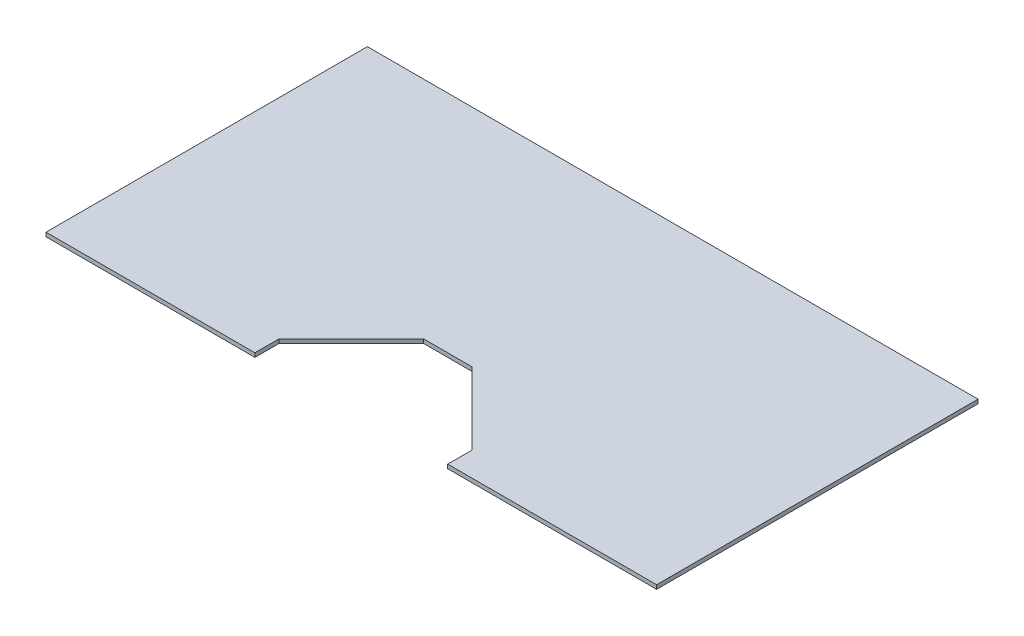
ISO-10303-21;
HEADER;
FILE_DESCRIPTION(('STEP AP214'),'2;1');
FILE_NAME('part.step','',(''),(''),'','','');
FILE_SCHEMA(('AUTOMOTIVE_DESIGN { 1 0 10303 214 1 1 1 1 }'));
ENDSEC;
DATA;
#1=APPLICATION_CONTEXT('core data for automotive mechanical design processes');
#2=APPLICATION_PROTOCOL_DEFINITION('international standard','automotive_design',2000,#1);
#3=PRODUCT_CONTEXT('',#1,'mechanical');
#4=PRODUCT('Part','Part','',(#3));
#5=PRODUCT_RELATED_PRODUCT_CATEGORY('part','',(#4));
#6=PRODUCT_DEFINITION_FORMATION('','',#4);
#7=PRODUCT_DEFINITION_CONTEXT('part definition',#1,'design');
#8=PRODUCT_DEFINITION('design','',#6,#7);
#9=PRODUCT_DEFINITION_SHAPE('','',#8);
#10=(LENGTH_UNIT() NAMED_UNIT(*) SI_UNIT(.MILLI.,.METRE.));
#11=(NAMED_UNIT(*) PLANE_ANGLE_UNIT() SI_UNIT($,.RADIAN.));
#12=(NAMED_UNIT(*) SI_UNIT($,.STERADIAN.) SOLID_ANGLE_UNIT());
#13=UNCERTAINTY_MEASURE_WITH_UNIT(LENGTH_MEASURE(1.E-05),#10,'distance_accuracy_value','');
#14=(GEOMETRIC_REPRESENTATION_CONTEXT(3) GLOBAL_UNCERTAINTY_ASSIGNED_CONTEXT((#13)) GLOBAL_UNIT_ASSIGNED_CONTEXT((#10,
#11,#12)) REPRESENTATION_CONTEXT('',''));
#15=CARTESIAN_POINT('',(0.,0.,0.));
#16=DIRECTION('',(0.,0.,1.));
#17=DIRECTION('',(1.,0.,0.));
#18=AXIS2_PLACEMENT_3D('',#15,#16,#17);
#19=CARTESIAN_POINT('',(0.,3.175,0.));
#20=DIRECTION('',(1.,0.,0.));
#21=DIRECTION('',(0.,0.,-1.));
#22=AXIS2_PLACEMENT_3D('',#19,#20,#21);
#23=PLANE('',#22);
#24=DIRECTION('',(0.,0.,1.));
#25=VECTOR('',#24,1.);
#26=CARTESIAN_POINT('',(0.,0.,0.));
#27=LINE('',#26,#25);
#28=CARTESIAN_POINT('',(0.,0.,-254.));
#29=VERTEX_POINT('',#28);
#30=CARTESIAN_POINT('',(0.,0.,0.));
#31=VERTEX_POINT('',#30);
#32=EDGE_CURVE('E116',#29,#31,#27,.T.);
#33=ORIENTED_EDGE('',*,*,#32,.T.);
#34=DIRECTION('',(0.,-1.,0.));
#35=VECTOR('',#34,1.);
#36=CARTESIAN_POINT('',(0.,3.175,0.));
#37=LINE('',#36,#35);
#38=CARTESIAN_POINT('',(0.,3.175,0.));
#39=VERTEX_POINT('',#38);
#40=EDGE_CURVE('E98',#39,#31,#37,.T.);
#41=ORIENTED_EDGE('',*,*,#40,.F.);
#42=DIRECTION('',(0.,0.,1.));
#43=VECTOR('',#42,1.);
#44=CARTESIAN_POINT('',(0.,3.175,0.));
#45=LINE('',#44,#43);
#46=CARTESIAN_POINT('',(0.,3.175,-254.));
#47=VERTEX_POINT('',#46);
#48=EDGE_CURVE('E104',#47,#39,#45,.T.);
#49=ORIENTED_EDGE('',*,*,#48,.F.);
#50=DIRECTION('',(0.,-1.,0.));
#51=VECTOR('',#50,1.);
#52=CARTESIAN_POINT('',(0.,3.175,-254.));
#53=LINE('',#52,#51);
#54=EDGE_CURVE('E172',#47,#29,#53,.T.);
#55=ORIENTED_EDGE('',*,*,#54,.T.);
#56=EDGE_LOOP('',(#33,#41,#49,#55));
#57=FACE_BOUND('',#56,.T.);
#58=ADVANCED_FACE('F17',(#57),#23,.F.);
#59=CARTESIAN_POINT('',(0.,3.175,0.));
#60=DIRECTION('',(0.,0.,-1.));
#61=DIRECTION('',(-1.,0.,0.));
#62=AXIS2_PLACEMENT_3D('',#59,#60,#61);
#63=PLANE('',#62);
#64=DIRECTION('',(1.,0.,0.));
#65=VECTOR('',#64,1.);
#66=CARTESIAN_POINT('',(0.,0.,0.));
#67=LINE('',#66,#65);
#68=CARTESIAN_POINT('',(165.1,0.,0.));
#69=VERTEX_POINT('',#68);
#70=EDGE_CURVE('E164',#31,#69,#67,.T.);
#71=ORIENTED_EDGE('',*,*,#70,.T.);
#72=DIRECTION('',(0.,-1.,0.));
#73=VECTOR('',#72,1.);
#74=CARTESIAN_POINT('',(165.1,3.175,0.));
#75=LINE('',#74,#73);
#76=CARTESIAN_POINT('',(165.1,3.175,0.));
#77=VERTEX_POINT('',#76);
#78=EDGE_CURVE('E101',#77,#69,#75,.T.);
#79=ORIENTED_EDGE('',*,*,#78,.F.);
#80=DIRECTION('',(1.,0.,0.));
#81=VECTOR('',#80,1.);
#82=CARTESIAN_POINT('',(0.,3.175,0.));
#83=LINE('',#82,#81);
#84=EDGE_CURVE('E94',#39,#77,#83,.T.);
#85=ORIENTED_EDGE('',*,*,#84,.F.);
#86=ORIENTED_EDGE('',*,*,#40,.T.);
#87=EDGE_LOOP('',(#71,#79,#85,#86));
#88=FACE_BOUND('',#87,.T.);
#89=ADVANCED_FACE('F96',(#88),#63,.F.);
#90=CARTESIAN_POINT('',(165.1,3.175,0.));
#91=DIRECTION('',(-1.,0.,0.));
#92=DIRECTION('',(0.,0.,1.));
#93=AXIS2_PLACEMENT_3D('',#90,#91,#92);
#94=PLANE('',#93);
#95=DIRECTION('',(0.,0.,-1.));
#96=VECTOR('',#95,1.);
#97=CARTESIAN_POINT('',(165.1,0.,0.));
#98=LINE('',#97,#96);
#99=CARTESIAN_POINT('',(165.1,0.,-19.05));
#100=VERTEX_POINT('',#99);
#101=EDGE_CURVE('E160',#69,#100,#98,.T.);
#102=ORIENTED_EDGE('',*,*,#101,.T.);
#103=DIRECTION('',(0.,1.,0.));
#104=VECTOR('',#103,1.);
#105=CARTESIAN_POINT('',(165.1,3.175,-19.05));
#106=LINE('',#105,#104);
#107=CARTESIAN_POINT('',(165.1,3.175,-19.05));
#108=VERTEX_POINT('',#107);
#109=EDGE_CURVE('E32',#100,#108,#106,.T.);
#110=ORIENTED_EDGE('',*,*,#109,.T.);
#111=DIRECTION('',(0.,0.,-1.));
#112=VECTOR('',#111,1.);
#113=CARTESIAN_POINT('',(165.1,3.175,0.));
#114=LINE('',#113,#112);
#115=EDGE_CURVE('E103',#77,#108,#114,.T.);
#116=ORIENTED_EDGE('',*,*,#115,.F.);
#117=ORIENTED_EDGE('',*,*,#78,.T.);
#118=EDGE_LOOP('',(#102,#110,#116,#117));
#119=FACE_BOUND('',#118,.T.);
#120=ADVANCED_FACE('F195',(#119),#94,.F.);
#121=CARTESIAN_POINT('',(165.1,3.175,-76.2));
#122=DIRECTION('',(0.,0.,-1.));
#123=DIRECTION('',(-1.,0.,0.));
#124=AXIS2_PLACEMENT_3D('',#121,#122,#123);
#125=PLANE('',#124);
#126=DIRECTION('',(1.,0.,0.));
#127=VECTOR('',#126,1.);
#128=CARTESIAN_POINT('',(165.1,0.,-76.2));
#129=LINE('',#128,#127);
#130=CARTESIAN_POINT('',(222.25,0.,-76.2));
#131=VERTEX_POINT('',#130);
#132=CARTESIAN_POINT('',(260.35,0.,-76.2));
#133=VERTEX_POINT('',#132);
#134=EDGE_CURVE('E154',#131,#133,#129,.T.);
#135=ORIENTED_EDGE('',*,*,#134,.T.);
#136=DIRECTION('',(0.,1.,0.));
#137=VECTOR('',#136,1.);
#138=CARTESIAN_POINT('',(260.35,3.175,-76.2));
#139=LINE('',#138,#137);
#140=CARTESIAN_POINT('',(260.35,3.175,-76.2));
#141=VERTEX_POINT('',#140);
#142=EDGE_CURVE('E128',#133,#141,#139,.T.);
#143=ORIENTED_EDGE('',*,*,#142,.T.);
#144=DIRECTION('',(1.,0.,0.));
#145=VECTOR('',#144,1.);
#146=CARTESIAN_POINT('',(165.1,3.175,-76.2));
#147=LINE('',#146,#145);
#148=CARTESIAN_POINT('',(222.25,3.175,-76.2));
#149=VERTEX_POINT('',#148);
#150=EDGE_CURVE('E140',#149,#141,#147,.T.);
#151=ORIENTED_EDGE('',*,*,#150,.F.);
#152=DIRECTION('',(0.,-1.,0.));
#153=VECTOR('',#152,1.);
#154=CARTESIAN_POINT('',(222.25,0.,-76.2));
#155=LINE('',#154,#153);
#156=EDGE_CURVE('E120',#149,#131,#155,.T.);
#157=ORIENTED_EDGE('',*,*,#156,.T.);
#158=EDGE_LOOP('',(#135,#143,#151,#157));
#159=FACE_BOUND('',#158,.T.);
#160=ADVANCED_FACE('F158',(#159),#125,.F.);
#161=CARTESIAN_POINT('',(317.5,3.175,-76.2));
#162=DIRECTION('',(1.,0.,0.));
#163=DIRECTION('',(0.,0.,-1.));
#164=AXIS2_PLACEMENT_3D('',#161,#162,#163);
#165=PLANE('',#164);
#166=DIRECTION('',(0.,0.,1.));
#167=VECTOR('',#166,1.);
#168=CARTESIAN_POINT('',(317.5,3.175,-76.2));
#169=LINE('',#168,#167);
#170=CARTESIAN_POINT('',(317.5,3.175,-19.0499999999995));
#171=VERTEX_POINT('',#170);
#172=CARTESIAN_POINT('',(317.5,3.175,0.));
#173=VERTEX_POINT('',#172);
#174=EDGE_CURVE('E137',#171,#173,#169,.T.);
#175=ORIENTED_EDGE('',*,*,#174,.F.);
#176=DIRECTION('',(0.,-1.,0.));
#177=VECTOR('',#176,1.);
#178=CARTESIAN_POINT('',(317.5,0.,-19.0499999999995));
#179=LINE('',#178,#177);
#180=CARTESIAN_POINT('',(317.5,0.,-19.0499999999995));
#181=VERTEX_POINT('',#180);
#182=EDGE_CURVE('E117',#171,#181,#179,.T.);
#183=ORIENTED_EDGE('',*,*,#182,.T.);
#184=DIRECTION('',(0.,0.,1.));
#185=VECTOR('',#184,1.);
#186=CARTESIAN_POINT('',(317.5,0.,-76.2));
#187=LINE('',#186,#185);
#188=CARTESIAN_POINT('',(317.5,0.,0.));
#189=VERTEX_POINT('',#188);
#190=EDGE_CURVE('E156',#181,#189,#187,.T.);
#191=ORIENTED_EDGE('',*,*,#190,.T.);
#192=DIRECTION('',(0.,-1.,0.));
#193=VECTOR('',#192,1.);
#194=CARTESIAN_POINT('',(317.5,3.175,0.));
#195=LINE('',#194,#193);
#196=EDGE_CURVE('E122',#173,#189,#195,.T.);
#197=ORIENTED_EDGE('',*,*,#196,.F.);
#198=EDGE_LOOP('',(#175,#183,#191,#197));
#199=FACE_BOUND('',#198,.T.);
#200=ADVANCED_FACE('F145',(#199),#165,.F.);
#201=CARTESIAN_POINT('',(317.5,3.175,0.));
#202=DIRECTION('',(0.,0.,-1.));
#203=DIRECTION('',(-1.,0.,0.));
#204=AXIS2_PLACEMENT_3D('',#201,#202,#203);
#205=PLANE('',#204);
#206=DIRECTION('',(1.,0.,0.));
#207=VECTOR('',#206,1.);
#208=CARTESIAN_POINT('',(317.5,0.,0.));
#209=LINE('',#208,#207);
#210=CARTESIAN_POINT('',(482.6,0.,0.));
#211=VERTEX_POINT('',#210);
#212=EDGE_CURVE('E162',#189,#211,#209,.T.);
#213=ORIENTED_EDGE('',*,*,#212,.T.);
#214=DIRECTION('',(0.,-1.,0.));
#215=VECTOR('',#214,1.);
#216=CARTESIAN_POINT('',(482.6,3.175,0.));
#217=LINE('',#216,#215);
#218=CARTESIAN_POINT('',(482.6,3.175,0.));
#219=VERTEX_POINT('',#218);
#220=EDGE_CURVE('E177',#219,#211,#217,.T.);
#221=ORIENTED_EDGE('',*,*,#220,.F.);
#222=DIRECTION('',(1.,0.,0.));
#223=VECTOR('',#222,1.);
#224=CARTESIAN_POINT('',(317.5,3.175,0.));
#225=LINE('',#224,#223);
#226=EDGE_CURVE('E149',#173,#219,#225,.T.);
#227=ORIENTED_EDGE('',*,*,#226,.F.);
#228=ORIENTED_EDGE('',*,*,#196,.T.);
#229=EDGE_LOOP('',(#213,#221,#227,#228));
#230=FACE_BOUND('',#229,.T.);
#231=ADVANCED_FACE('F180',(#230),#205,.F.);
#232=CARTESIAN_POINT('',(482.6,3.175,0.));
#233=DIRECTION('',(-1.,0.,0.));
#234=DIRECTION('',(0.,0.,1.));
#235=AXIS2_PLACEMENT_3D('',#232,#233,#234);
#236=PLANE('',#235);
#237=DIRECTION('',(0.,0.,-1.));
#238=VECTOR('',#237,1.);
#239=CARTESIAN_POINT('',(482.6,0.,0.));
#240=LINE('',#239,#238);
#241=CARTESIAN_POINT('',(482.6,0.,-254.));
#242=VERTEX_POINT('',#241);
#243=EDGE_CURVE('E169',#211,#242,#240,.T.);
#244=ORIENTED_EDGE('',*,*,#243,.T.);
#245=DIRECTION('',(0.,-1.,0.));
#246=VECTOR('',#245,1.);
#247=CARTESIAN_POINT('',(482.6,3.175,-254.));
#248=LINE('',#247,#246);
#249=CARTESIAN_POINT('',(482.6,3.175,-254.));
#250=VERTEX_POINT('',#249);
#251=EDGE_CURVE('E174',#250,#242,#248,.T.);
#252=ORIENTED_EDGE('',*,*,#251,.F.);
#253=DIRECTION('',(0.,0.,-1.));
#254=VECTOR('',#253,1.);
#255=CARTESIAN_POINT('',(482.6,3.175,0.));
#256=LINE('',#255,#254);
#257=EDGE_CURVE('E190',#219,#250,#256,.T.);
#258=ORIENTED_EDGE('',*,*,#257,.F.);
#259=ORIENTED_EDGE('',*,*,#220,.T.);
#260=EDGE_LOOP('',(#244,#252,#258,#259));
#261=FACE_BOUND('',#260,.T.);
#262=ADVANCED_FACE('F186',(#261),#236,.F.);
#263=CARTESIAN_POINT('',(0.,3.175,-254.));
#264=DIRECTION('',(0.,0.,1.));
#265=DIRECTION('',(1.,0.,0.));
#266=AXIS2_PLACEMENT_3D('',#263,#264,#265);
#267=PLANE('',#266);
#268=DIRECTION('',(-1.,0.,0.));
#269=VECTOR('',#268,1.);
#270=CARTESIAN_POINT('',(0.,0.,-254.));
#271=LINE('',#270,#269);
#272=EDGE_CURVE('E113',#242,#29,#271,.T.);
#273=ORIENTED_EDGE('',*,*,#272,.T.);
#274=ORIENTED_EDGE('',*,*,#54,.F.);
#275=DIRECTION('',(-1.,0.,0.));
#276=VECTOR('',#275,1.);
#277=CARTESIAN_POINT('',(0.,3.175,-254.));
#278=LINE('',#277,#276);
#279=EDGE_CURVE('E109',#250,#47,#278,.T.);
#280=ORIENTED_EDGE('',*,*,#279,.F.);
#281=ORIENTED_EDGE('',*,*,#251,.T.);
#282=EDGE_LOOP('',(#273,#274,#280,#281));
#283=FACE_BOUND('',#282,.T.);
#284=ADVANCED_FACE('F189',(#283),#267,.F.);
#285=CARTESIAN_POINT('',(0.,3.175,-254.));
#286=DIRECTION('',(0.,-1.,0.));
#287=DIRECTION('',(0.,0.,-1.));
#288=AXIS2_PLACEMENT_3D('',#285,#286,#287);
#289=PLANE('',#288);
#290=ORIENTED_EDGE('',*,*,#48,.T.);
#291=ORIENTED_EDGE('',*,*,#84,.T.);
#292=ORIENTED_EDGE('',*,*,#115,.T.);
#293=DIRECTION('',(-0.707106781186551,0.,0.707106781186544));
#294=VECTOR('',#293,1.);
#295=CARTESIAN_POINT('',(200.025,3.175,-53.9749999999988));
#296=LINE('',#295,#294);
#297=EDGE_CURVE('E11',#108,#149,#296,.F.);
#298=ORIENTED_EDGE('',*,*,#297,.T.);
#299=ORIENTED_EDGE('',*,*,#150,.T.);
#300=DIRECTION('',(-0.707106781186544,0.,-0.707106781186551));
#301=VECTOR('',#300,1.);
#302=CARTESIAN_POINT('',(41.2750000000015,3.175,-295.275));
#303=LINE('',#302,#301);
#304=EDGE_CURVE('E133',#141,#171,#303,.F.);
#305=ORIENTED_EDGE('',*,*,#304,.T.);
#306=ORIENTED_EDGE('',*,*,#174,.T.);
#307=ORIENTED_EDGE('',*,*,#226,.T.);
#308=ORIENTED_EDGE('',*,*,#257,.T.);
#309=ORIENTED_EDGE('',*,*,#279,.T.);
#310=EDGE_LOOP('',(#290,#291,#292,#298,#299,#305,#306,#307,#308,#309));
#311=FACE_BOUND('',#310,.T.);
#312=ADVANCED_FACE('F107',(#311),#289,.F.);
#313=CARTESIAN_POINT('',(0.,0.,-254.));
#314=DIRECTION('',(0.,-1.,0.));
#315=DIRECTION('',(0.,0.,-1.));
#316=AXIS2_PLACEMENT_3D('',#313,#314,#315);
#317=PLANE('',#316);
#318=ORIENTED_EDGE('',*,*,#32,.F.);
#319=ORIENTED_EDGE('',*,*,#272,.F.);
#320=ORIENTED_EDGE('',*,*,#243,.F.);
#321=ORIENTED_EDGE('',*,*,#212,.F.);
#322=ORIENTED_EDGE('',*,*,#190,.F.);
#323=DIRECTION('',(0.707106781186544,0.,0.707106781186551));
#324=VECTOR('',#323,1.);
#325=CARTESIAN_POINT('',(317.5,0.,-19.0499999999995));
#326=LINE('',#325,#324);
#327=EDGE_CURVE('E131',#181,#133,#326,.F.);
#328=ORIENTED_EDGE('',*,*,#327,.T.);
#329=ORIENTED_EDGE('',*,*,#134,.F.);
#330=DIRECTION('',(0.707106781186551,0.,-0.707106781186544));
#331=VECTOR('',#330,1.);
#332=CARTESIAN_POINT('',(222.25,0.,-76.2));
#333=LINE('',#332,#331);
#334=EDGE_CURVE('E25',#131,#100,#333,.F.);
#335=ORIENTED_EDGE('',*,*,#334,.T.);
#336=ORIENTED_EDGE('',*,*,#101,.F.);
#337=ORIENTED_EDGE('',*,*,#70,.F.);
#338=EDGE_LOOP('',(#318,#319,#320,#321,#322,#328,#329,#335,#336,#337));
#339=FACE_BOUND('',#338,.T.);
#340=ADVANCED_FACE('F153',(#339),#317,.T.);
#341=CARTESIAN_POINT('',(317.5,3.175,-19.0499999999995));
#342=DIRECTION('',(-0.707106781186551,0.,0.707106781186544));
#343=DIRECTION('',(0.707106781186544,0.,0.707106781186551));
#344=AXIS2_PLACEMENT_3D('',#341,#342,#343);
#345=PLANE('',#344);
#346=ORIENTED_EDGE('',*,*,#304,.F.);
#347=ORIENTED_EDGE('',*,*,#142,.F.);
#348=ORIENTED_EDGE('',*,*,#327,.F.);
#349=ORIENTED_EDGE('',*,*,#182,.F.);
#350=EDGE_LOOP('',(#346,#347,#348,#349));
#351=FACE_BOUND('',#350,.T.);
#352=ADVANCED_FACE('F151',(#351),#345,.T.);
#353=CARTESIAN_POINT('',(222.25,3.175,-76.2));
#354=DIRECTION('',(0.707106781186544,0.,0.707106781186551));
#355=DIRECTION('',(0.707106781186551,0.,-0.707106781186544));
#356=AXIS2_PLACEMENT_3D('',#353,#354,#355);
#357=PLANE('',#356);
#358=ORIENTED_EDGE('',*,*,#297,.F.);
#359=ORIENTED_EDGE('',*,*,#109,.F.);
#360=ORIENTED_EDGE('',*,*,#334,.F.);
#361=ORIENTED_EDGE('',*,*,#156,.F.);
#362=EDGE_LOOP('',(#358,#359,#360,#361));
#363=FACE_BOUND('',#362,.T.);
#364=ADVANCED_FACE('F19',(#363),#357,.T.);
#365=CLOSED_SHELL('',(#58,#89,#120,#160,#200,#231,#262,#284,#312,#340,#352,#364));
#366=MANIFOLD_SOLID_BREP('B1',#365);
#367=ADVANCED_BREP_SHAPE_REPRESENTATION('',(#18,#366),#14);
#368=SHAPE_DEFINITION_REPRESENTATION(#9,#367);
ENDSEC;
END-ISO-10303-21;
